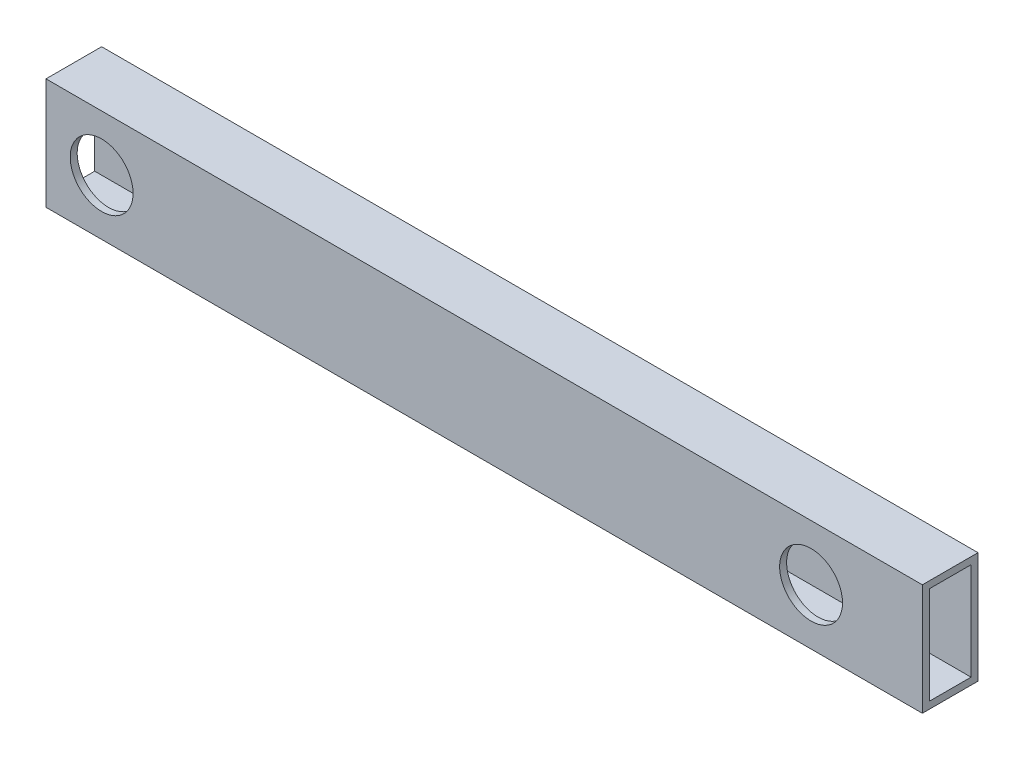
ISO-10303-21;
HEADER;
FILE_DESCRIPTION(('STEP AP214'),'2;1');
FILE_NAME('part.step','',(''),(''),'','','');
FILE_SCHEMA(('AUTOMOTIVE_DESIGN { 1 0 10303 214 1 1 1 1 }'));
ENDSEC;
DATA;
#1=APPLICATION_CONTEXT('core data for automotive mechanical design processes');
#2=APPLICATION_PROTOCOL_DEFINITION('international standard','automotive_design',2000,#1);
#3=PRODUCT_CONTEXT('',#1,'mechanical');
#4=PRODUCT('Part','Part','',(#3));
#5=PRODUCT_RELATED_PRODUCT_CATEGORY('part','',(#4));
#6=PRODUCT_DEFINITION_FORMATION('','',#4);
#7=PRODUCT_DEFINITION_CONTEXT('part definition',#1,'design');
#8=PRODUCT_DEFINITION('design','',#6,#7);
#9=PRODUCT_DEFINITION_SHAPE('','',#8);
#10=(LENGTH_UNIT() NAMED_UNIT(*) SI_UNIT(.MILLI.,.METRE.));
#11=(NAMED_UNIT(*) PLANE_ANGLE_UNIT() SI_UNIT($,.RADIAN.));
#12=(NAMED_UNIT(*) SI_UNIT($,.STERADIAN.) SOLID_ANGLE_UNIT());
#13=UNCERTAINTY_MEASURE_WITH_UNIT(LENGTH_MEASURE(1.E-05),#10,'distance_accuracy_value','');
#14=(GEOMETRIC_REPRESENTATION_CONTEXT(3) GLOBAL_UNCERTAINTY_ASSIGNED_CONTEXT((#13)) GLOBAL_UNIT_ASSIGNED_CONTEXT((#10,
#11,#12)) REPRESENTATION_CONTEXT('',''));
#15=CARTESIAN_POINT('',(0.,0.,0.));
#16=DIRECTION('',(0.,0.,1.));
#17=DIRECTION('',(1.,0.,0.));
#18=AXIS2_PLACEMENT_3D('',#15,#16,#17);
#19=CARTESIAN_POINT('',(400.05,0.,0.));
#20=DIRECTION('',(-1.,0.,0.));
#21=DIRECTION('',(0.,0.,1.));
#22=AXIS2_PLACEMENT_3D('',#19,#20,#21);
#23=PLANE('',#22);
#24=DIRECTION('',(0.,-1.,0.));
#25=VECTOR('',#24,1.);
#26=CARTESIAN_POINT('',(400.05,0.,0.));
#27=LINE('',#26,#25);
#28=CARTESIAN_POINT('',(400.05,50.8,0.));
#29=VERTEX_POINT('',#28);
#30=CARTESIAN_POINT('',(400.05,0.,0.));
#31=VERTEX_POINT('',#30);
#32=EDGE_CURVE('E143',#29,#31,#27,.T.);
#33=ORIENTED_EDGE('',*,*,#32,.T.);
#34=DIRECTION('',(0.,0.,-1.));
#35=VECTOR('',#34,1.);
#36=CARTESIAN_POINT('',(400.05,0.,0.));
#37=LINE('',#36,#35);
#38=CARTESIAN_POINT('',(400.05,0.,-25.4));
#39=VERTEX_POINT('',#38);
#40=EDGE_CURVE('E146',#31,#39,#37,.T.);
#41=ORIENTED_EDGE('',*,*,#40,.T.);
#42=DIRECTION('',(0.,1.,0.));
#43=VECTOR('',#42,1.);
#44=CARTESIAN_POINT('',(400.05,0.,-25.4));
#45=LINE('',#44,#43);
#46=CARTESIAN_POINT('',(400.05,50.8,-25.4));
#47=VERTEX_POINT('',#46);
#48=EDGE_CURVE('E149',#39,#47,#45,.T.);
#49=ORIENTED_EDGE('',*,*,#48,.T.);
#50=DIRECTION('',(0.,0.,1.));
#51=VECTOR('',#50,1.);
#52=CARTESIAN_POINT('',(400.05,50.8,0.));
#53=LINE('',#52,#51);
#54=EDGE_CURVE('E151',#47,#29,#53,.T.);
#55=ORIENTED_EDGE('',*,*,#54,.T.);
#56=EDGE_LOOP('',(#33,#41,#49,#55));
#57=FACE_BOUND('',#56,.T.);
#58=DIRECTION('',(0.,-1.,0.));
#59=VECTOR('',#58,1.);
#60=CARTESIAN_POINT('',(400.05,3.175,-3.175));
#61=LINE('',#60,#59);
#62=CARTESIAN_POINT('',(400.05,47.625,-3.175));
#63=VERTEX_POINT('',#62);
#64=CARTESIAN_POINT('',(400.05,3.175,-3.175));
#65=VERTEX_POINT('',#64);
#66=EDGE_CURVE('E105',#63,#65,#61,.T.);
#67=ORIENTED_EDGE('',*,*,#66,.F.);
#68=DIRECTION('',(0.,0.,1.));
#69=VECTOR('',#68,1.);
#70=CARTESIAN_POINT('',(400.05,47.625,-3.175));
#71=LINE('',#70,#69);
#72=CARTESIAN_POINT('',(400.05,47.625,-22.225));
#73=VERTEX_POINT('',#72);
#74=EDGE_CURVE('E127',#73,#63,#71,.T.);
#75=ORIENTED_EDGE('',*,*,#74,.F.);
#76=DIRECTION('',(0.,1.,0.));
#77=VECTOR('',#76,1.);
#78=CARTESIAN_POINT('',(400.05,3.175,-22.225));
#79=LINE('',#78,#77);
#80=CARTESIAN_POINT('',(400.05,3.175,-22.225));
#81=VERTEX_POINT('',#80);
#82=EDGE_CURVE('E125',#81,#73,#79,.T.);
#83=ORIENTED_EDGE('',*,*,#82,.F.);
#84=DIRECTION('',(0.,0.,-1.));
#85=VECTOR('',#84,1.);
#86=CARTESIAN_POINT('',(400.05,3.175,-3.175));
#87=LINE('',#86,#85);
#88=EDGE_CURVE('E113',#65,#81,#87,.T.);
#89=ORIENTED_EDGE('',*,*,#88,.F.);
#90=EDGE_LOOP('',(#67,#75,#83,#89));
#91=FACE_BOUND('',#90,.T.);
#92=ADVANCED_FACE('F38',(#57,#91),#23,.F.);
#93=CARTESIAN_POINT('',(0.,0.,0.));
#94=DIRECTION('',(-1.,0.,0.));
#95=DIRECTION('',(0.,0.,1.));
#96=AXIS2_PLACEMENT_3D('',#93,#94,#95);
#97=PLANE('',#96);
#98=DIRECTION('',(0.,-1.,0.));
#99=VECTOR('',#98,1.);
#100=CARTESIAN_POINT('',(0.,0.,0.));
#101=LINE('',#100,#99);
#102=CARTESIAN_POINT('',(0.,50.8,0.));
#103=VERTEX_POINT('',#102);
#104=CARTESIAN_POINT('',(0.,0.,0.));
#105=VERTEX_POINT('',#104);
#106=EDGE_CURVE('E121',#103,#105,#101,.T.);
#107=ORIENTED_EDGE('',*,*,#106,.F.);
#108=DIRECTION('',(0.,0.,1.));
#109=VECTOR('',#108,1.);
#110=CARTESIAN_POINT('',(0.,50.8,0.));
#111=LINE('',#110,#109);
#112=CARTESIAN_POINT('',(0.,50.8,-25.4));
#113=VERTEX_POINT('',#112);
#114=EDGE_CURVE('E147',#113,#103,#111,.T.);
#115=ORIENTED_EDGE('',*,*,#114,.F.);
#116=DIRECTION('',(0.,1.,0.));
#117=VECTOR('',#116,1.);
#118=CARTESIAN_POINT('',(0.,0.,-25.4));
#119=LINE('',#118,#117);
#120=CARTESIAN_POINT('',(0.,0.,-25.4));
#121=VERTEX_POINT('',#120);
#122=EDGE_CURVE('E158',#121,#113,#119,.T.);
#123=ORIENTED_EDGE('',*,*,#122,.F.);
#124=DIRECTION('',(0.,0.,-1.));
#125=VECTOR('',#124,1.);
#126=CARTESIAN_POINT('',(0.,0.,0.));
#127=LINE('',#126,#125);
#128=EDGE_CURVE('E156',#105,#121,#127,.T.);
#129=ORIENTED_EDGE('',*,*,#128,.F.);
#130=EDGE_LOOP('',(#107,#115,#123,#129));
#131=FACE_BOUND('',#130,.T.);
#132=DIRECTION('',(0.,0.,1.));
#133=VECTOR('',#132,1.);
#134=CARTESIAN_POINT('',(0.,47.625,-3.175));
#135=LINE('',#134,#133);
#136=CARTESIAN_POINT('',(0.,47.625,-22.225));
#137=VERTEX_POINT('',#136);
#138=CARTESIAN_POINT('',(0.,47.625,-3.175));
#139=VERTEX_POINT('',#138);
#140=EDGE_CURVE('E114',#137,#139,#135,.T.);
#141=ORIENTED_EDGE('',*,*,#140,.T.);
#142=DIRECTION('',(0.,-1.,0.));
#143=VECTOR('',#142,1.);
#144=CARTESIAN_POINT('',(0.,3.175,-3.175));
#145=LINE('',#144,#143);
#146=CARTESIAN_POINT('',(0.,3.175,-3.175));
#147=VERTEX_POINT('',#146);
#148=EDGE_CURVE('E63',#139,#147,#145,.T.);
#149=ORIENTED_EDGE('',*,*,#148,.T.);
#150=DIRECTION('',(0.,0.,-1.));
#151=VECTOR('',#150,1.);
#152=CARTESIAN_POINT('',(0.,3.175,-3.175));
#153=LINE('',#152,#151);
#154=CARTESIAN_POINT('',(0.,3.175,-22.225));
#155=VERTEX_POINT('',#154);
#156=EDGE_CURVE('E120',#147,#155,#153,.T.);
#157=ORIENTED_EDGE('',*,*,#156,.T.);
#158=DIRECTION('',(0.,1.,0.));
#159=VECTOR('',#158,1.);
#160=CARTESIAN_POINT('',(0.,3.175,-22.225));
#161=LINE('',#160,#159);
#162=EDGE_CURVE('E135',#155,#137,#161,.T.);
#163=ORIENTED_EDGE('',*,*,#162,.T.);
#164=EDGE_LOOP('',(#141,#149,#157,#163));
#165=FACE_BOUND('',#164,.T.);
#166=ADVANCED_FACE('F204',(#131,#165),#97,.T.);
#167=CARTESIAN_POINT('',(400.05,0.,0.));
#168=DIRECTION('',(0.,0.,-1.));
#169=DIRECTION('',(-1.,0.,0.));
#170=AXIS2_PLACEMENT_3D('',#167,#168,#169);
#171=PLANE('',#170);
#172=CARTESIAN_POINT('',(349.25,25.4,0.));
#173=DIRECTION('',(0.,0.,1.));
#174=DIRECTION('',(1.,0.,0.));
#175=AXIS2_PLACEMENT_3D('',#172,#173,#174);
#176=CIRCLE('',#175,14.351);
#177=CARTESIAN_POINT('',(363.601,25.4,0.));
#178=VERTEX_POINT('',#177);
#179=EDGE_CURVE('E176',#178,#178,#176,.T.);
#180=ORIENTED_EDGE('',*,*,#179,.F.);
#181=EDGE_LOOP('',(#180));
#182=FACE_BOUND('',#181,.T.);
#183=CARTESIAN_POINT('',(25.4,25.4,0.));
#184=DIRECTION('',(0.,0.,1.));
#185=DIRECTION('',(1.,0.,0.));
#186=AXIS2_PLACEMENT_3D('',#183,#184,#185);
#187=CIRCLE('',#186,14.351);
#188=CARTESIAN_POINT('',(39.751,25.4,0.));
#189=VERTEX_POINT('',#188);
#190=EDGE_CURVE('E184',#189,#189,#187,.T.);
#191=ORIENTED_EDGE('',*,*,#190,.F.);
#192=EDGE_LOOP('',(#191));
#193=FACE_BOUND('',#192,.T.);
#194=ORIENTED_EDGE('',*,*,#106,.T.);
#195=DIRECTION('',(-1.,0.,0.));
#196=VECTOR('',#195,1.);
#197=CARTESIAN_POINT('',(400.05,0.,0.));
#198=LINE('',#197,#196);
#199=EDGE_CURVE('E11',#31,#105,#198,.T.);
#200=ORIENTED_EDGE('',*,*,#199,.F.);
#201=ORIENTED_EDGE('',*,*,#32,.F.);
#202=DIRECTION('',(-1.,0.,0.));
#203=VECTOR('',#202,1.);
#204=CARTESIAN_POINT('',(400.05,50.8,0.));
#205=LINE('',#204,#203);
#206=EDGE_CURVE('E153',#29,#103,#205,.T.);
#207=ORIENTED_EDGE('',*,*,#206,.T.);
#208=EDGE_LOOP('',(#194,#200,#201,#207));
#209=FACE_BOUND('',#208,.T.);
#210=ADVANCED_FACE('F40',(#182,#193,#209),#171,.F.);
#211=CARTESIAN_POINT('',(400.05,0.,0.));
#212=DIRECTION('',(0.,1.,0.));
#213=DIRECTION('',(0.,0.,1.));
#214=AXIS2_PLACEMENT_3D('',#211,#212,#213);
#215=PLANE('',#214);
#216=ORIENTED_EDGE('',*,*,#128,.T.);
#217=DIRECTION('',(-1.,0.,0.));
#218=VECTOR('',#217,1.);
#219=CARTESIAN_POINT('',(400.05,0.,-25.4));
#220=LINE('',#219,#218);
#221=EDGE_CURVE('E47',#39,#121,#220,.T.);
#222=ORIENTED_EDGE('',*,*,#221,.F.);
#223=ORIENTED_EDGE('',*,*,#40,.F.);
#224=ORIENTED_EDGE('',*,*,#199,.T.);
#225=EDGE_LOOP('',(#216,#222,#223,#224));
#226=FACE_BOUND('',#225,.T.);
#227=ADVANCED_FACE('F230',(#226),#215,.F.);
#228=CARTESIAN_POINT('',(400.05,0.,-25.4));
#229=DIRECTION('',(0.,0.,1.));
#230=DIRECTION('',(1.,0.,0.));
#231=AXIS2_PLACEMENT_3D('',#228,#229,#230);
#232=PLANE('',#231);
#233=CARTESIAN_POINT('',(349.25,25.4,-25.4));
#234=DIRECTION('',(0.,0.,1.));
#235=DIRECTION('',(1.,0.,0.));
#236=AXIS2_PLACEMENT_3D('',#233,#234,#235);
#237=CIRCLE('',#236,14.351);
#238=CARTESIAN_POINT('',(363.601,25.4,-25.4));
#239=VERTEX_POINT('',#238);
#240=EDGE_CURVE('E170',#239,#239,#237,.F.);
#241=ORIENTED_EDGE('',*,*,#240,.F.);
#242=EDGE_LOOP('',(#241));
#243=FACE_BOUND('',#242,.T.);
#244=CARTESIAN_POINT('',(25.4,25.4,-25.4));
#245=DIRECTION('',(0.,0.,1.));
#246=DIRECTION('',(1.,0.,0.));
#247=AXIS2_PLACEMENT_3D('',#244,#245,#246);
#248=CIRCLE('',#247,14.351);
#249=CARTESIAN_POINT('',(39.751,25.4,-25.4));
#250=VERTEX_POINT('',#249);
#251=EDGE_CURVE('E181',#250,#250,#248,.F.);
#252=ORIENTED_EDGE('',*,*,#251,.F.);
#253=EDGE_LOOP('',(#252));
#254=FACE_BOUND('',#253,.T.);
#255=ORIENTED_EDGE('',*,*,#122,.T.);
#256=DIRECTION('',(-1.,0.,0.));
#257=VECTOR('',#256,1.);
#258=CARTESIAN_POINT('',(400.05,50.8,-25.4));
#259=LINE('',#258,#257);
#260=EDGE_CURVE('E163',#47,#113,#259,.T.);
#261=ORIENTED_EDGE('',*,*,#260,.F.);
#262=ORIENTED_EDGE('',*,*,#48,.F.);
#263=ORIENTED_EDGE('',*,*,#221,.T.);
#264=EDGE_LOOP('',(#255,#261,#262,#263));
#265=FACE_BOUND('',#264,.T.);
#266=ADVANCED_FACE('F227',(#243,#254,#265),#232,.F.);
#267=CARTESIAN_POINT('',(400.05,50.8,0.));
#268=DIRECTION('',(0.,-1.,0.));
#269=DIRECTION('',(0.,0.,-1.));
#270=AXIS2_PLACEMENT_3D('',#267,#268,#269);
#271=PLANE('',#270);
#272=ORIENTED_EDGE('',*,*,#114,.T.);
#273=ORIENTED_EDGE('',*,*,#206,.F.);
#274=ORIENTED_EDGE('',*,*,#54,.F.);
#275=ORIENTED_EDGE('',*,*,#260,.T.);
#276=EDGE_LOOP('',(#272,#273,#274,#275));
#277=FACE_BOUND('',#276,.T.);
#278=ADVANCED_FACE('F224',(#277),#271,.F.);
#279=CARTESIAN_POINT('',(400.05,3.175,-3.175));
#280=DIRECTION('',(0.,0.,-1.));
#281=DIRECTION('',(-1.,0.,0.));
#282=AXIS2_PLACEMENT_3D('',#279,#280,#281);
#283=PLANE('',#282);
#284=CARTESIAN_POINT('',(349.25,25.4,-3.175));
#285=DIRECTION('',(0.,0.,-1.));
#286=DIRECTION('',(-1.,0.,0.));
#287=AXIS2_PLACEMENT_3D('',#284,#285,#286);
#288=CIRCLE('',#287,14.351);
#289=CARTESIAN_POINT('',(334.899,25.4,-3.175));
#290=VERTEX_POINT('',#289);
#291=EDGE_CURVE('E133',#290,#290,#288,.T.);
#292=ORIENTED_EDGE('',*,*,#291,.F.);
#293=EDGE_LOOP('',(#292));
#294=FACE_BOUND('',#293,.T.);
#295=CARTESIAN_POINT('',(25.4,25.4,-3.175));
#296=DIRECTION('',(0.,0.,-1.));
#297=DIRECTION('',(-1.,0.,0.));
#298=AXIS2_PLACEMENT_3D('',#295,#296,#297);
#299=CIRCLE('',#298,14.351);
#300=CARTESIAN_POINT('',(11.049,25.4,-3.175));
#301=VERTEX_POINT('',#300);
#302=EDGE_CURVE('E169',#301,#301,#299,.T.);
#303=ORIENTED_EDGE('',*,*,#302,.F.);
#304=EDGE_LOOP('',(#303));
#305=FACE_BOUND('',#304,.T.);
#306=ORIENTED_EDGE('',*,*,#148,.F.);
#307=DIRECTION('',(-1.,0.,0.));
#308=VECTOR('',#307,1.);
#309=CARTESIAN_POINT('',(400.05,47.625,-3.175));
#310=LINE('',#309,#308);
#311=EDGE_CURVE('E109',#63,#139,#310,.T.);
#312=ORIENTED_EDGE('',*,*,#311,.F.);
#313=ORIENTED_EDGE('',*,*,#66,.T.);
#314=DIRECTION('',(-1.,0.,0.));
#315=VECTOR('',#314,1.);
#316=CARTESIAN_POINT('',(400.05,3.175,-3.175));
#317=LINE('',#316,#315);
#318=EDGE_CURVE('E108',#65,#147,#317,.T.);
#319=ORIENTED_EDGE('',*,*,#318,.T.);
#320=EDGE_LOOP('',(#306,#312,#313,#319));
#321=FACE_BOUND('',#320,.T.);
#322=ADVANCED_FACE('F107',(#294,#305,#321),#283,.T.);
#323=CARTESIAN_POINT('',(400.05,3.175,-3.175));
#324=DIRECTION('',(0.,1.,0.));
#325=DIRECTION('',(0.,0.,1.));
#326=AXIS2_PLACEMENT_3D('',#323,#324,#325);
#327=PLANE('',#326);
#328=ORIENTED_EDGE('',*,*,#156,.F.);
#329=ORIENTED_EDGE('',*,*,#318,.F.);
#330=ORIENTED_EDGE('',*,*,#88,.T.);
#331=DIRECTION('',(-1.,0.,0.));
#332=VECTOR('',#331,1.);
#333=CARTESIAN_POINT('',(400.05,3.175,-22.225));
#334=LINE('',#333,#332);
#335=EDGE_CURVE('E122',#81,#155,#334,.T.);
#336=ORIENTED_EDGE('',*,*,#335,.T.);
#337=EDGE_LOOP('',(#328,#329,#330,#336));
#338=FACE_BOUND('',#337,.T.);
#339=ADVANCED_FACE('F117',(#338),#327,.T.);
#340=CARTESIAN_POINT('',(400.05,3.175,-22.225));
#341=DIRECTION('',(0.,0.,1.));
#342=DIRECTION('',(1.,0.,0.));
#343=AXIS2_PLACEMENT_3D('',#340,#341,#342);
#344=PLANE('',#343);
#345=CARTESIAN_POINT('',(349.25,25.4,-22.225));
#346=DIRECTION('',(0.,0.,1.));
#347=DIRECTION('',(1.,0.,0.));
#348=AXIS2_PLACEMENT_3D('',#345,#346,#347);
#349=CIRCLE('',#348,14.351);
#350=CARTESIAN_POINT('',(363.601,25.4,-22.225));
#351=VERTEX_POINT('',#350);
#352=EDGE_CURVE('E42',#351,#351,#349,.T.);
#353=ORIENTED_EDGE('',*,*,#352,.F.);
#354=EDGE_LOOP('',(#353));
#355=FACE_BOUND('',#354,.T.);
#356=CARTESIAN_POINT('',(25.4,25.4,-22.225));
#357=DIRECTION('',(0.,0.,1.));
#358=DIRECTION('',(1.,0.,0.));
#359=AXIS2_PLACEMENT_3D('',#356,#357,#358);
#360=CIRCLE('',#359,14.351);
#361=CARTESIAN_POINT('',(39.751,25.4,-22.225));
#362=VERTEX_POINT('',#361);
#363=EDGE_CURVE('E167',#362,#362,#360,.T.);
#364=ORIENTED_EDGE('',*,*,#363,.F.);
#365=EDGE_LOOP('',(#364));
#366=FACE_BOUND('',#365,.T.);
#367=ORIENTED_EDGE('',*,*,#162,.F.);
#368=ORIENTED_EDGE('',*,*,#335,.F.);
#369=ORIENTED_EDGE('',*,*,#82,.T.);
#370=DIRECTION('',(-1.,0.,0.));
#371=VECTOR('',#370,1.);
#372=CARTESIAN_POINT('',(400.05,47.625,-22.225));
#373=LINE('',#372,#371);
#374=EDGE_CURVE('E55',#73,#137,#373,.T.);
#375=ORIENTED_EDGE('',*,*,#374,.T.);
#376=EDGE_LOOP('',(#367,#368,#369,#375));
#377=FACE_BOUND('',#376,.T.);
#378=ADVANCED_FACE('F196',(#355,#366,#377),#344,.T.);
#379=CARTESIAN_POINT('',(400.05,47.625,-3.175));
#380=DIRECTION('',(0.,-1.,0.));
#381=DIRECTION('',(0.,0.,-1.));
#382=AXIS2_PLACEMENT_3D('',#379,#380,#381);
#383=PLANE('',#382);
#384=ORIENTED_EDGE('',*,*,#140,.F.);
#385=ORIENTED_EDGE('',*,*,#374,.F.);
#386=ORIENTED_EDGE('',*,*,#74,.T.);
#387=ORIENTED_EDGE('',*,*,#311,.T.);
#388=EDGE_LOOP('',(#384,#385,#386,#387));
#389=FACE_BOUND('',#388,.T.);
#390=ADVANCED_FACE('F199',(#389),#383,.T.);
#391=CARTESIAN_POINT('',(25.4,25.4,-65.9907576672326));
#392=DIRECTION('',(0.,0.,1.));
#393=DIRECTION('',(1.,0.,0.));
#394=AXIS2_PLACEMENT_3D('',#391,#392,#393);
#395=CYLINDRICAL_SURFACE('',#394,14.351);
#396=ORIENTED_EDGE('',*,*,#363,.T.);
#397=EDGE_LOOP('',(#396));
#398=FACE_BOUND('',#397,.T.);
#399=ORIENTED_EDGE('',*,*,#251,.T.);
#400=EDGE_LOOP('',(#399));
#401=FACE_BOUND('',#400,.T.);
#402=ADVANCED_FACE('F206',(#398,#401),#395,.F.);
#403=CARTESIAN_POINT('',(349.25,25.4,-65.9907576672326));
#404=DIRECTION('',(0.,0.,1.));
#405=DIRECTION('',(1.,0.,0.));
#406=AXIS2_PLACEMENT_3D('',#403,#404,#405);
#407=CYLINDRICAL_SURFACE('',#406,14.351);
#408=ORIENTED_EDGE('',*,*,#352,.T.);
#409=EDGE_LOOP('',(#408));
#410=FACE_BOUND('',#409,.T.);
#411=ORIENTED_EDGE('',*,*,#240,.T.);
#412=EDGE_LOOP('',(#411));
#413=FACE_BOUND('',#412,.T.);
#414=ADVANCED_FACE('F194',(#410,#413),#407,.F.);
#415=ORIENTED_EDGE('',*,*,#302,.T.);
#416=EDGE_LOOP('',(#415));
#417=FACE_BOUND('',#416,.T.);
#418=ORIENTED_EDGE('',*,*,#190,.T.);
#419=EDGE_LOOP('',(#418));
#420=FACE_BOUND('',#419,.T.);
#421=ADVANCED_FACE('F212',(#417,#420),#395,.F.);
#422=ORIENTED_EDGE('',*,*,#291,.T.);
#423=EDGE_LOOP('',(#422));
#424=FACE_BOUND('',#423,.T.);
#425=ORIENTED_EDGE('',*,*,#179,.T.);
#426=EDGE_LOOP('',(#425));
#427=FACE_BOUND('',#426,.T.);
#428=ADVANCED_FACE('F257',(#424,#427),#407,.F.);
#429=CLOSED_SHELL('',(#92,#166,#210,#227,#266,#278,#322,#339,#378,#390,#402,#414,#421,#428));
#430=MANIFOLD_SOLID_BREP('B2',#429);
#431=ADVANCED_BREP_SHAPE_REPRESENTATION('',(#18,#430),#14);
#432=SHAPE_DEFINITION_REPRESENTATION(#9,#431);
ENDSEC;
END-ISO-10303-21;
